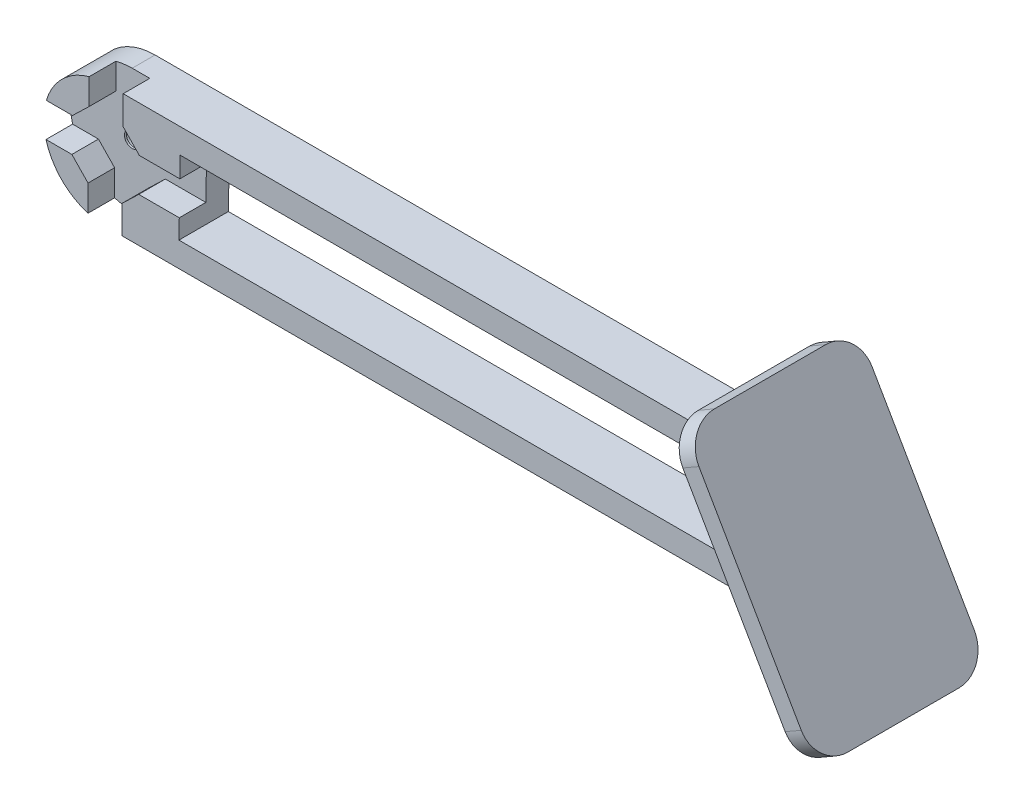
ISO-10303-21;
HEADER;
FILE_DESCRIPTION(('STEP AP214'),'2;1');
FILE_NAME('part.step','',(''),(''),'','','');
FILE_SCHEMA(('AUTOMOTIVE_DESIGN { 1 0 10303 214 1 1 1 1 }'));
ENDSEC;
DATA;
#1=APPLICATION_CONTEXT('core data for automotive mechanical design processes');
#2=APPLICATION_PROTOCOL_DEFINITION('international standard','automotive_design',2000,#1);
#3=PRODUCT_CONTEXT('',#1,'mechanical');
#4=PRODUCT('Part','Part','',(#3));
#5=PRODUCT_RELATED_PRODUCT_CATEGORY('part','',(#4));
#6=PRODUCT_DEFINITION_FORMATION('','',#4);
#7=PRODUCT_DEFINITION_CONTEXT('part definition',#1,'design');
#8=PRODUCT_DEFINITION('design','',#6,#7);
#9=PRODUCT_DEFINITION_SHAPE('','',#8);
#10=(LENGTH_UNIT() NAMED_UNIT(*) SI_UNIT(.MILLI.,.METRE.));
#11=(NAMED_UNIT(*) PLANE_ANGLE_UNIT() SI_UNIT($,.RADIAN.));
#12=(NAMED_UNIT(*) SI_UNIT($,.STERADIAN.) SOLID_ANGLE_UNIT());
#13=UNCERTAINTY_MEASURE_WITH_UNIT(LENGTH_MEASURE(1.E-05),#10,'distance_accuracy_value','');
#14=(GEOMETRIC_REPRESENTATION_CONTEXT(3) GLOBAL_UNCERTAINTY_ASSIGNED_CONTEXT((#13)) GLOBAL_UNIT_ASSIGNED_CONTEXT((#10,
#11,#12)) REPRESENTATION_CONTEXT('',''));
#15=CARTESIAN_POINT('',(0.,0.,0.));
#16=DIRECTION('',(0.,0.,1.));
#17=DIRECTION('',(1.,0.,0.));
#18=AXIS2_PLACEMENT_3D('',#15,#16,#17);
#19=CARTESIAN_POINT('',(0.,10.,8.));
#20=DIRECTION('',(0.,0.,-1.));
#21=DIRECTION('',(-1.,0.,0.));
#22=AXIS2_PLACEMENT_3D('',#19,#20,#21);
#23=PLANE('',#22);
#24=DIRECTION('',(1.,0.,0.));
#25=VECTOR('',#24,1.);
#26=CARTESIAN_POINT('',(11.8571549210606,4.,8.));
#27=LINE('',#26,#25);
#28=CARTESIAN_POINT('',(11.8571549210606,4.,8.));
#29=VERTEX_POINT('',#28);
#30=CARTESIAN_POINT('',(109.607695154587,4.,8.));
#31=VERTEX_POINT('',#30);
#32=EDGE_CURVE('E278',#29,#31,#27,.T.);
#33=ORIENTED_EDGE('',*,*,#32,.F.);
#34=DIRECTION('',(-0.0174947062329612,-0.999846955915665,0.));
#35=VECTOR('',#34,1.);
#36=CARTESIAN_POINT('',(11.8571549210606,4.,8.));
#37=LINE('',#36,#35);
#38=CARTESIAN_POINT('',(11.9123657659527,7.15537708743099,8.));
#39=VERTEX_POINT('',#38);
#40=EDGE_CURVE('E264',#39,#29,#37,.T.);
#41=ORIENTED_EDGE('',*,*,#40,.F.);
#42=DIRECTION('',(1.,0.,0.));
#43=VECTOR('',#42,1.);
#44=CARTESIAN_POINT('',(5.3597141305402,7.15537708743099,8.));
#45=LINE('',#44,#43);
#46=CARTESIAN_POINT('',(5.3597141305402,7.15537708743099,8.));
#47=VERTEX_POINT('',#46);
#48=EDGE_CURVE('E388',#47,#39,#45,.T.);
#49=ORIENTED_EDGE('',*,*,#48,.F.);
#50=DIRECTION('',(0.719369188088886,0.694627937264502,0.));
#51=VECTOR('',#50,1.);
#52=CARTESIAN_POINT('',(2.65537708743099,4.54405025688731,8.));
#53=LINE('',#52,#51);
#54=CARTESIAN_POINT('',(2.65537708743099,4.54405025688731,8.));
#55=VERTEX_POINT('',#54);
#56=EDGE_CURVE('E385',#55,#47,#53,.T.);
#57=ORIENTED_EDGE('',*,*,#56,.F.);
#58=DIRECTION('',(0.,1.,0.));
#59=VECTOR('',#58,1.);
#60=CARTESIAN_POINT('',(2.65537708743099,4.54405025688731,8.));
#61=LINE('',#60,#59);
#62=CARTESIAN_POINT('',(2.65537708743099,0.,8.));
#63=VERTEX_POINT('',#62);
#64=EDGE_CURVE('E383',#63,#55,#61,.T.);
#65=ORIENTED_EDGE('',*,*,#64,.F.);
#66=DIRECTION('',(1.,0.,0.));
#67=VECTOR('',#66,1.);
#68=CARTESIAN_POINT('',(0.,0.,8.));
#69=LINE('',#68,#67);
#70=CARTESIAN_POINT('',(116.535898384862,0.,8.));
#71=VERTEX_POINT('',#70);
#72=EDGE_CURVE('E456',#63,#71,#69,.T.);
#73=ORIENTED_EDGE('',*,*,#72,.T.);
#74=DIRECTION('',(-0.499999999999998,0.86602540378444,0.));
#75=VECTOR('',#74,1.);
#76=CARTESIAN_POINT('',(83.0717967697248,57.9615242270662,8.));
#77=LINE('',#76,#75);
#78=CARTESIAN_POINT('',(104.98889300107,20.,8.));
#79=VERTEX_POINT('',#78);
#80=EDGE_CURVE('E316',#71,#79,#77,.T.);
#81=ORIENTED_EDGE('',*,*,#80,.T.);
#82=DIRECTION('',(-1.,0.,0.));
#83=VECTOR('',#82,1.);
#84=CARTESIAN_POINT('',(0.,20.,8.));
#85=LINE('',#84,#83);
#86=CARTESIAN_POINT('',(2.84462291256901,20.,8.));
#87=VERTEX_POINT('',#86);
#88=EDGE_CURVE('E459',#79,#87,#85,.T.);
#89=ORIENTED_EDGE('',*,*,#88,.T.);
#90=DIRECTION('',(0.,1.,0.));
#91=VECTOR('',#90,1.);
#92=CARTESIAN_POINT('',(2.84462291256901,15.3597141305402,8.));
#93=LINE('',#92,#91);
#94=CARTESIAN_POINT('',(2.84462291256901,15.3597141305402,8.));
#95=VERTEX_POINT('',#94);
#96=EDGE_CURVE('E334',#95,#87,#93,.T.);
#97=ORIENTED_EDGE('',*,*,#96,.F.);
#98=DIRECTION('',(-0.694627937264501,0.719369188088887,0.));
#99=VECTOR('',#98,1.);
#100=CARTESIAN_POINT('',(5.45594974311269,12.655377087431,8.));
#101=LINE('',#100,#99);
#102=CARTESIAN_POINT('',(5.45594974311269,12.655377087431,8.));
#103=VERTEX_POINT('',#102);
#104=EDGE_CURVE('E394',#103,#95,#101,.T.);
#105=ORIENTED_EDGE('',*,*,#104,.F.);
#106=DIRECTION('',(-1.,0.,0.));
#107=VECTOR('',#106,1.);
#108=CARTESIAN_POINT('',(5.45594974311269,12.655377087431,8.));
#109=LINE('',#108,#107);
#110=CARTESIAN_POINT('',(12.0086013785251,12.655377087431,8.));
#111=VERTEX_POINT('',#110);
#112=EDGE_CURVE('E391',#111,#103,#109,.T.);
#113=ORIENTED_EDGE('',*,*,#112,.F.);
#114=CARTESIAN_POINT('',(12.0671235303097,16.,8.));
#115=VERTEX_POINT('',#114);
#116=EDGE_CURVE('E272',#115,#111,#37,.T.);
#117=ORIENTED_EDGE('',*,*,#116,.F.);
#118=DIRECTION('',(-1.,0.,0.));
#119=VECTOR('',#118,1.);
#120=CARTESIAN_POINT('',(12.0671235303097,16.,8.));
#121=LINE('',#120,#119);
#122=CARTESIAN_POINT('',(102.679491924311,16.,8.));
#123=VERTEX_POINT('',#122);
#124=EDGE_CURVE('E265',#123,#115,#121,.T.);
#125=ORIENTED_EDGE('',*,*,#124,.F.);
#126=DIRECTION('',(-0.5,0.866025403784439,0.));
#127=VECTOR('',#126,1.);
#128=CARTESIAN_POINT('',(109.607695154587,4.,8.));
#129=LINE('',#128,#127);
#130=EDGE_CURVE('E280',#31,#123,#129,.T.);
#131=ORIENTED_EDGE('',*,*,#130,.F.);
#132=EDGE_LOOP('',(#33,#41,#49,#57,#65,#73,#81,#89,#97,#105,#113,#117,#125,#131));
#133=FACE_BOUND('',#132,.T.);
#134=ADVANCED_FACE('F35',(#133),#23,.F.);
#135=CARTESIAN_POINT('',(0.,10.,8.));
#136=DIRECTION('',(0.,0.,1.));
#137=DIRECTION('',(-1.,0.,0.));
#138=AXIS2_PLACEMENT_3D('',#135,#136,#137);
#139=CIRCLE('',#138,10.);
#140=CARTESIAN_POINT('',(-9.64100474657837,7.34462291256902,8.));
#141=VERTEX_POINT('',#140);
#142=CARTESIAN_POINT('',(-2.84462291256901,0.413127700585169,8.));
#143=VERTEX_POINT('',#142);
#144=EDGE_CURVE('E451',#141,#143,#139,.T.);
#145=ORIENTED_EDGE('',*,*,#144,.T.);
#146=DIRECTION('',(0.,-1.,0.));
#147=VECTOR('',#146,1.);
#148=CARTESIAN_POINT('',(-2.84462291256901,-1.91236576595265,8.));
#149=LINE('',#148,#147);
#150=CARTESIAN_POINT('',(-2.84462291256901,4.6402858694598,8.));
#151=VERTEX_POINT('',#150);
#152=EDGE_CURVE('E381',#151,#143,#149,.T.);
#153=ORIENTED_EDGE('',*,*,#152,.F.);
#154=DIRECTION('',(0.694627937264501,-0.719369188088887,0.));
#155=VECTOR('',#154,1.);
#156=CARTESIAN_POINT('',(-5.45594974311269,7.34462291256902,8.));
#157=LINE('',#156,#155);
#158=CARTESIAN_POINT('',(-5.45594974311269,7.34462291256902,8.));
#159=VERTEX_POINT('',#158);
#160=EDGE_CURVE('E378',#159,#151,#157,.T.);
#161=ORIENTED_EDGE('',*,*,#160,.F.);
#162=DIRECTION('',(1.,0.,0.));
#163=VECTOR('',#162,1.);
#164=CARTESIAN_POINT('',(-5.45594974311269,7.34462291256902,8.));
#165=LINE('',#164,#163);
#166=EDGE_CURVE('E376',#141,#159,#165,.T.);
#167=ORIENTED_EDGE('',*,*,#166,.F.);
#168=EDGE_LOOP('',(#145,#153,#161,#167));
#169=FACE_BOUND('',#168,.T.);
#170=ADVANCED_FACE('F545',(#169),#23,.F.);
#171=CARTESIAN_POINT('',(0.,10.,8.));
#172=DIRECTION('',(0.,0.,-1.));
#173=DIRECTION('',(-1.,0.,0.));
#174=AXIS2_PLACEMENT_3D('',#171,#172,#173);
#175=CYLINDRICAL_SURFACE('',#174,10.);
#176=CARTESIAN_POINT('',(-2.65537708743099,19.6410047465784,8.));
#177=VERTEX_POINT('',#176);
#178=CARTESIAN_POINT('',(-9.58687229941484,12.844622912569,8.));
#179=VERTEX_POINT('',#178);
#180=EDGE_CURVE('E454',#177,#179,#139,.T.);
#181=ORIENTED_EDGE('',*,*,#180,.F.);
#182=DIRECTION('',(0.,0.,-1.));
#183=VECTOR('',#182,1.);
#184=CARTESIAN_POINT('',(-2.65537708743099,19.6410047465784,8.));
#185=LINE('',#184,#183);
#186=CARTESIAN_POINT('',(-2.65537708743099,19.6410047465784,3.7));
#187=VERTEX_POINT('',#186);
#188=EDGE_CURVE('E447',#177,#187,#185,.T.);
#189=ORIENTED_EDGE('',*,*,#188,.T.);
#190=CARTESIAN_POINT('',(0.,10.,3.7));
#191=DIRECTION('',(0.,0.,-1.));
#192=DIRECTION('',(-1.,0.,0.));
#193=AXIS2_PLACEMENT_3D('',#190,#191,#192);
#194=CIRCLE('',#193,10.);
#195=CARTESIAN_POINT('',(0.,20.,3.7));
#196=VERTEX_POINT('',#195);
#197=EDGE_CURVE('E424',#187,#196,#194,.T.);
#198=ORIENTED_EDGE('',*,*,#197,.T.);
#199=DIRECTION('',(0.,0.,-1.));
#200=VECTOR('',#199,1.);
#201=CARTESIAN_POINT('',(0.,20.,8.));
#202=LINE('',#201,#200);
#203=CARTESIAN_POINT('',(0.,20.,0.));
#204=VERTEX_POINT('',#203);
#205=EDGE_CURVE('E461',#196,#204,#202,.T.);
#206=ORIENTED_EDGE('',*,*,#205,.T.);
#207=CARTESIAN_POINT('',(0.,10.,0.));
#208=DIRECTION('',(0.,0.,1.));
#209=DIRECTION('',(-1.,0.,0.));
#210=AXIS2_PLACEMENT_3D('',#207,#208,#209);
#211=CIRCLE('',#210,10.);
#212=CARTESIAN_POINT('',(0.,0.,0.));
#213=VERTEX_POINT('',#212);
#214=EDGE_CURVE('E450',#204,#213,#211,.T.);
#215=ORIENTED_EDGE('',*,*,#214,.T.);
#216=DIRECTION('',(0.,0.,-1.));
#217=VECTOR('',#216,1.);
#218=CARTESIAN_POINT('',(0.,0.,8.));
#219=LINE('',#218,#217);
#220=CARTESIAN_POINT('',(0.,0.,3.7));
#221=VERTEX_POINT('',#220);
#222=EDGE_CURVE('E470',#221,#213,#219,.T.);
#223=ORIENTED_EDGE('',*,*,#222,.F.);
#224=CARTESIAN_POINT('',(-2.84462291256901,0.413127700585169,3.7));
#225=VERTEX_POINT('',#224);
#226=EDGE_CURVE('E429',#221,#225,#194,.T.);
#227=ORIENTED_EDGE('',*,*,#226,.T.);
#228=DIRECTION('',(0.,0.,-1.));
#229=VECTOR('',#228,1.);
#230=CARTESIAN_POINT('',(-2.84462291256901,0.413127700585171,8.));
#231=LINE('',#230,#229);
#232=EDGE_CURVE('E438',#225,#143,#231,.F.);
#233=ORIENTED_EDGE('',*,*,#232,.T.);
#234=ORIENTED_EDGE('',*,*,#144,.F.);
#235=DIRECTION('',(0.,0.,-1.));
#236=VECTOR('',#235,1.);
#237=CARTESIAN_POINT('',(-9.64100474657837,7.34462291256902,8.));
#238=LINE('',#237,#236);
#239=CARTESIAN_POINT('',(-9.64100474657837,7.34462291256902,3.7));
#240=VERTEX_POINT('',#239);
#241=EDGE_CURVE('E435',#141,#240,#238,.T.);
#242=ORIENTED_EDGE('',*,*,#241,.T.);
#243=CARTESIAN_POINT('',(-9.58687229941484,12.844622912569,3.7));
#244=VERTEX_POINT('',#243);
#245=EDGE_CURVE('E428',#240,#244,#194,.T.);
#246=ORIENTED_EDGE('',*,*,#245,.T.);
#247=DIRECTION('',(0.,0.,-1.));
#248=VECTOR('',#247,1.);
#249=CARTESIAN_POINT('',(-9.58687229941484,12.844622912569,8.));
#250=LINE('',#249,#248);
#251=EDGE_CURVE('E432',#244,#179,#250,.F.);
#252=ORIENTED_EDGE('',*,*,#251,.T.);
#253=EDGE_LOOP('',(#181,#189,#198,#206,#215,#223,#227,#233,#234,#242,#246,#252));
#254=FACE_BOUND('',#253,.T.);
#255=ADVANCED_FACE('F552',(#254),#175,.T.);
#256=CARTESIAN_POINT('',(0.,0.,8.));
#257=DIRECTION('',(0.,1.,0.));
#258=DIRECTION('',(0.,0.,1.));
#259=AXIS2_PLACEMENT_3D('',#256,#257,#258);
#260=PLANE('',#259);
#261=DIRECTION('',(1.,0.,0.));
#262=VECTOR('',#261,1.);
#263=CARTESIAN_POINT('',(0.,0.,0.));
#264=LINE('',#263,#262);
#265=CARTESIAN_POINT('',(116.535898384862,0.,0.));
#266=VERTEX_POINT('',#265);
#267=EDGE_CURVE('E464',#213,#266,#264,.T.);
#268=ORIENTED_EDGE('',*,*,#267,.T.);
#269=DIRECTION('',(0.,0.,1.));
#270=VECTOR('',#269,1.);
#271=CARTESIAN_POINT('',(116.535898384862,0.,8.));
#272=LINE('',#271,#270);
#273=EDGE_CURVE('E314',#266,#71,#272,.T.);
#274=ORIENTED_EDGE('',*,*,#273,.T.);
#275=ORIENTED_EDGE('',*,*,#72,.F.);
#276=DIRECTION('',(0.,0.,-1.));
#277=VECTOR('',#276,1.);
#278=CARTESIAN_POINT('',(2.65537708743099,0.,8.));
#279=LINE('',#278,#277);
#280=CARTESIAN_POINT('',(2.65537708743099,0.,3.7));
#281=VERTEX_POINT('',#280);
#282=EDGE_CURVE('E441',#63,#281,#279,.T.);
#283=ORIENTED_EDGE('',*,*,#282,.T.);
#284=DIRECTION('',(-1.,0.,0.));
#285=VECTOR('',#284,1.);
#286=CARTESIAN_POINT('',(0.,0.,3.7));
#287=LINE('',#286,#285);
#288=EDGE_CURVE('E427',#281,#221,#287,.T.);
#289=ORIENTED_EDGE('',*,*,#288,.T.);
#290=ORIENTED_EDGE('',*,*,#222,.T.);
#291=EDGE_LOOP('',(#268,#274,#275,#283,#289,#290));
#292=FACE_BOUND('',#291,.T.);
#293=ADVANCED_FACE('F564',(#292),#260,.F.);
#294=CARTESIAN_POINT('',(0.,20.,8.));
#295=DIRECTION('',(0.,-1.,0.));
#296=DIRECTION('',(0.,0.,-1.));
#297=AXIS2_PLACEMENT_3D('',#294,#295,#296);
#298=PLANE('',#297);
#299=ORIENTED_EDGE('',*,*,#88,.F.);
#300=DIRECTION('',(0.,0.,-1.));
#301=VECTOR('',#300,1.);
#302=CARTESIAN_POINT('',(104.98889300107,20.,8.));
#303=LINE('',#302,#301);
#304=CARTESIAN_POINT('',(104.98889300107,20.,0.));
#305=VERTEX_POINT('',#304);
#306=EDGE_CURVE('E301',#79,#305,#303,.T.);
#307=ORIENTED_EDGE('',*,*,#306,.T.);
#308=DIRECTION('',(-1.,0.,0.));
#309=VECTOR('',#308,1.);
#310=CARTESIAN_POINT('',(0.,20.,0.));
#311=LINE('',#310,#309);
#312=EDGE_CURVE('E455',#305,#204,#311,.T.);
#313=ORIENTED_EDGE('',*,*,#312,.T.);
#314=ORIENTED_EDGE('',*,*,#205,.F.);
#315=DIRECTION('',(1.,0.,0.));
#316=VECTOR('',#315,1.);
#317=CARTESIAN_POINT('',(0.,20.,3.7));
#318=LINE('',#317,#316);
#319=CARTESIAN_POINT('',(2.84462291256901,20.,3.7));
#320=VERTEX_POINT('',#319);
#321=EDGE_CURVE('E401',#196,#320,#318,.T.);
#322=ORIENTED_EDGE('',*,*,#321,.T.);
#323=DIRECTION('',(0.,0.,1.));
#324=VECTOR('',#323,1.);
#325=CARTESIAN_POINT('',(2.84462291256901,20.,8.));
#326=LINE('',#325,#324);
#327=EDGE_CURVE('E444',#320,#87,#326,.T.);
#328=ORIENTED_EDGE('',*,*,#327,.T.);
#329=EDGE_LOOP('',(#299,#307,#313,#314,#322,#328));
#330=FACE_BOUND('',#329,.T.);
#331=ADVANCED_FACE('F557',(#330),#298,.F.);
#332=DIRECTION('',(-0.719369188088887,-0.694627937264501,0.));
#333=VECTOR('',#332,1.);
#334=CARTESIAN_POINT('',(-2.65537708743099,15.4559497431127,8.));
#335=LINE('',#334,#333);
#336=CARTESIAN_POINT('',(-2.65537708743099,15.4559497431127,8.));
#337=VERTEX_POINT('',#336);
#338=CARTESIAN_POINT('',(-5.3597141305402,12.844622912569,8.));
#339=VERTEX_POINT('',#338);
#340=EDGE_CURVE('E371',#337,#339,#335,.T.);
#341=ORIENTED_EDGE('',*,*,#340,.F.);
#342=DIRECTION('',(0.,-1.,0.));
#343=VECTOR('',#342,1.);
#344=CARTESIAN_POINT('',(-2.65537708743099,15.4559497431127,8.));
#345=LINE('',#344,#343);
#346=EDGE_CURVE('E328',#177,#337,#345,.T.);
#347=ORIENTED_EDGE('',*,*,#346,.F.);
#348=ORIENTED_EDGE('',*,*,#180,.T.);
#349=DIRECTION('',(-1.,0.,0.));
#350=VECTOR('',#349,1.);
#351=CARTESIAN_POINT('',(-5.3597141305402,12.844622912569,8.));
#352=LINE('',#351,#350);
#353=EDGE_CURVE('E374',#339,#179,#352,.T.);
#354=ORIENTED_EDGE('',*,*,#353,.F.);
#355=EDGE_LOOP('',(#341,#347,#348,#354));
#356=FACE_BOUND('',#355,.T.);
#357=ADVANCED_FACE('F548',(#356),#23,.F.);
#358=CARTESIAN_POINT('',(0.,10.,0.));
#359=DIRECTION('',(0.,0.,-1.));
#360=DIRECTION('',(-1.,0.,0.));
#361=AXIS2_PLACEMENT_3D('',#358,#359,#360);
#362=PLANE('',#361);
#363=DIRECTION('',(-0.0174947062329612,-0.999846955915665,0.));
#364=VECTOR('',#363,1.);
#365=CARTESIAN_POINT('',(11.8571549210606,4.,0.));
#366=LINE('',#365,#364);
#367=CARTESIAN_POINT('',(12.0671235303097,16.,0.));
#368=VERTEX_POINT('',#367);
#369=CARTESIAN_POINT('',(11.8571549210606,4.,0.));
#370=VERTEX_POINT('',#369);
#371=EDGE_CURVE('E261',#368,#370,#366,.T.);
#372=ORIENTED_EDGE('',*,*,#371,.T.);
#373=DIRECTION('',(1.,0.,0.));
#374=VECTOR('',#373,1.);
#375=CARTESIAN_POINT('',(11.8571549210606,4.,0.));
#376=LINE('',#375,#374);
#377=CARTESIAN_POINT('',(109.607695154587,4.,0.));
#378=VERTEX_POINT('',#377);
#379=EDGE_CURVE('E245',#370,#378,#376,.T.);
#380=ORIENTED_EDGE('',*,*,#379,.T.);
#381=DIRECTION('',(-0.5,0.866025403784439,0.));
#382=VECTOR('',#381,1.);
#383=CARTESIAN_POINT('',(109.607695154587,4.,0.));
#384=LINE('',#383,#382);
#385=CARTESIAN_POINT('',(102.679491924311,16.,0.));
#386=VERTEX_POINT('',#385);
#387=EDGE_CURVE('E274',#378,#386,#384,.T.);
#388=ORIENTED_EDGE('',*,*,#387,.T.);
#389=DIRECTION('',(-1.,0.,0.));
#390=VECTOR('',#389,1.);
#391=CARTESIAN_POINT('',(12.0671235303097,16.,0.));
#392=LINE('',#391,#390);
#393=EDGE_CURVE('E270',#386,#368,#392,.T.);
#394=ORIENTED_EDGE('',*,*,#393,.T.);
#395=EDGE_LOOP('',(#372,#380,#388,#394));
#396=FACE_BOUND('',#395,.T.);
#397=DIRECTION('',(-0.499999999999998,0.86602540378444,0.));
#398=VECTOR('',#397,1.);
#399=CARTESIAN_POINT('',(83.0717967697248,57.9615242270662,0.));
#400=LINE('',#399,#398);
#401=EDGE_CURVE('E472',#266,#305,#400,.T.);
#402=ORIENTED_EDGE('',*,*,#401,.F.);
#403=ORIENTED_EDGE('',*,*,#267,.F.);
#404=ORIENTED_EDGE('',*,*,#214,.F.);
#405=ORIENTED_EDGE('',*,*,#312,.F.);
#406=EDGE_LOOP('',(#402,#403,#404,#405));
#407=FACE_BOUND('',#406,.T.);
#408=CARTESIAN_POINT('',(0.,10.,0.));
#409=DIRECTION('',(0.,0.,-1.));
#410=DIRECTION('',(-1.,0.,0.));
#411=AXIS2_PLACEMENT_3D('',#408,#409,#410);
#412=CIRCLE('',#411,2.5);
#413=CARTESIAN_POINT('',(-2.5,10.,0.));
#414=VERTEX_POINT('',#413);
#415=EDGE_CURVE('E322',#414,#414,#412,.T.);
#416=ORIENTED_EDGE('',*,*,#415,.F.);
#417=EDGE_LOOP('',(#416));
#418=FACE_BOUND('',#417,.T.);
#419=ADVANCED_FACE('F268',(#396,#407,#418),#362,.T.);
#420=CARTESIAN_POINT('',(-2.65537708743099,15.4559497431127,3.7));
#421=DIRECTION('',(-1.,0.,0.));
#422=DIRECTION('',(0.,0.,1.));
#423=AXIS2_PLACEMENT_3D('',#420,#421,#422);
#424=PLANE('',#423);
#425=ORIENTED_EDGE('',*,*,#346,.T.);
#426=DIRECTION('',(0.,0.,1.));
#427=VECTOR('',#426,1.);
#428=CARTESIAN_POINT('',(-2.65537708743099,15.4559497431127,3.7));
#429=LINE('',#428,#427);
#430=CARTESIAN_POINT('',(-2.65537708743099,15.4559497431127,3.7));
#431=VERTEX_POINT('',#430);
#432=EDGE_CURVE('E368',#431,#337,#429,.T.);
#433=ORIENTED_EDGE('',*,*,#432,.F.);
#434=DIRECTION('',(0.,-1.,0.));
#435=VECTOR('',#434,1.);
#436=CARTESIAN_POINT('',(-2.65537708743099,15.4559497431127,3.7));
#437=LINE('',#436,#435);
#438=EDGE_CURVE('E331',#187,#431,#437,.T.);
#439=ORIENTED_EDGE('',*,*,#438,.F.);
#440=ORIENTED_EDGE('',*,*,#188,.F.);
#441=EDGE_LOOP('',(#425,#433,#439,#440));
#442=FACE_BOUND('',#441,.T.);
#443=ADVANCED_FACE('F563',(#442),#424,.F.);
#444=CARTESIAN_POINT('',(2.84462291256901,15.3597141305402,3.7));
#445=DIRECTION('',(1.,0.,0.));
#446=DIRECTION('',(0.,0.,-1.));
#447=AXIS2_PLACEMENT_3D('',#444,#445,#446);
#448=PLANE('',#447);
#449=DIRECTION('',(0.,1.,0.));
#450=VECTOR('',#449,1.);
#451=CARTESIAN_POINT('',(2.84462291256901,15.3597141305402,3.7));
#452=LINE('',#451,#450);
#453=CARTESIAN_POINT('',(2.84462291256901,15.3597141305402,3.7));
#454=VERTEX_POINT('',#453);
#455=EDGE_CURVE('E365',#454,#320,#452,.T.);
#456=ORIENTED_EDGE('',*,*,#455,.F.);
#457=DIRECTION('',(0.,0.,1.));
#458=VECTOR('',#457,1.);
#459=CARTESIAN_POINT('',(2.84462291256901,15.3597141305402,3.7));
#460=LINE('',#459,#458);
#461=EDGE_CURVE('E399',#454,#95,#460,.T.);
#462=ORIENTED_EDGE('',*,*,#461,.T.);
#463=ORIENTED_EDGE('',*,*,#96,.T.);
#464=ORIENTED_EDGE('',*,*,#327,.F.);
#465=EDGE_LOOP('',(#456,#462,#463,#464));
#466=FACE_BOUND('',#465,.T.);
#467=ADVANCED_FACE('F627',(#466),#448,.F.);
#468=CARTESIAN_POINT('',(2.65537708743099,4.54405025688731,3.7));
#469=DIRECTION('',(1.,0.,0.));
#470=DIRECTION('',(0.,0.,-1.));
#471=AXIS2_PLACEMENT_3D('',#468,#469,#470);
#472=PLANE('',#471);
#473=ORIENTED_EDGE('',*,*,#64,.T.);
#474=DIRECTION('',(0.,0.,1.));
#475=VECTOR('',#474,1.);
#476=CARTESIAN_POINT('',(2.65537708743099,4.54405025688731,3.7));
#477=LINE('',#476,#475);
#478=CARTESIAN_POINT('',(2.65537708743099,4.54405025688731,3.7));
#479=VERTEX_POINT('',#478);
#480=EDGE_CURVE('E411',#479,#55,#477,.T.);
#481=ORIENTED_EDGE('',*,*,#480,.F.);
#482=DIRECTION('',(0.,1.,0.));
#483=VECTOR('',#482,1.);
#484=CARTESIAN_POINT('',(2.65537708743099,4.54405025688731,3.7));
#485=LINE('',#484,#483);
#486=EDGE_CURVE('E348',#281,#479,#485,.T.);
#487=ORIENTED_EDGE('',*,*,#486,.F.);
#488=ORIENTED_EDGE('',*,*,#282,.F.);
#489=EDGE_LOOP('',(#473,#481,#487,#488));
#490=FACE_BOUND('',#489,.T.);
#491=ADVANCED_FACE('F603',(#490),#472,.F.);
#492=CARTESIAN_POINT('',(-2.84462291256901,-1.91236576595265,3.7));
#493=DIRECTION('',(-1.,0.,0.));
#494=DIRECTION('',(0.,0.,1.));
#495=AXIS2_PLACEMENT_3D('',#492,#493,#494);
#496=PLANE('',#495);
#497=DIRECTION('',(0.,-1.,0.));
#498=VECTOR('',#497,1.);
#499=CARTESIAN_POINT('',(-2.84462291256901,-1.91236576595265,3.7));
#500=LINE('',#499,#498);
#501=CARTESIAN_POINT('',(-2.84462291256901,4.6402858694598,3.7));
#502=VERTEX_POINT('',#501);
#503=EDGE_CURVE('E345',#502,#225,#500,.T.);
#504=ORIENTED_EDGE('',*,*,#503,.F.);
#505=DIRECTION('',(0.,0.,1.));
#506=VECTOR('',#505,1.);
#507=CARTESIAN_POINT('',(-2.84462291256901,4.6402858694598,3.7));
#508=LINE('',#507,#506);
#509=EDGE_CURVE('E414',#502,#151,#508,.T.);
#510=ORIENTED_EDGE('',*,*,#509,.T.);
#511=ORIENTED_EDGE('',*,*,#152,.T.);
#512=ORIENTED_EDGE('',*,*,#232,.F.);
#513=EDGE_LOOP('',(#504,#510,#511,#512));
#514=FACE_BOUND('',#513,.T.);
#515=ADVANCED_FACE('F619',(#514),#496,.F.);
#516=CARTESIAN_POINT('',(-5.45594974311269,7.34462291256902,3.7));
#517=DIRECTION('',(0.,-1.,0.));
#518=DIRECTION('',(0.,0.,-1.));
#519=AXIS2_PLACEMENT_3D('',#516,#517,#518);
#520=PLANE('',#519);
#521=ORIENTED_EDGE('',*,*,#166,.T.);
#522=DIRECTION('',(0.,0.,1.));
#523=VECTOR('',#522,1.);
#524=CARTESIAN_POINT('',(-5.45594974311269,7.34462291256902,3.7));
#525=LINE('',#524,#523);
#526=CARTESIAN_POINT('',(-5.45594974311269,7.34462291256902,3.7));
#527=VERTEX_POINT('',#526);
#528=EDGE_CURVE('E416',#527,#159,#525,.T.);
#529=ORIENTED_EDGE('',*,*,#528,.F.);
#530=DIRECTION('',(1.,0.,0.));
#531=VECTOR('',#530,1.);
#532=CARTESIAN_POINT('',(-5.45594974311269,7.34462291256902,3.7));
#533=LINE('',#532,#531);
#534=EDGE_CURVE('E340',#240,#527,#533,.T.);
#535=ORIENTED_EDGE('',*,*,#534,.F.);
#536=ORIENTED_EDGE('',*,*,#241,.F.);
#537=EDGE_LOOP('',(#521,#529,#535,#536));
#538=FACE_BOUND('',#537,.T.);
#539=ADVANCED_FACE('F615',(#538),#520,.F.);
#540=CARTESIAN_POINT('',(-5.3597141305402,12.844622912569,3.7));
#541=DIRECTION('',(0.,1.,0.));
#542=DIRECTION('',(0.,0.,1.));
#543=AXIS2_PLACEMENT_3D('',#540,#541,#542);
#544=PLANE('',#543);
#545=DIRECTION('',(-1.,0.,0.));
#546=VECTOR('',#545,1.);
#547=CARTESIAN_POINT('',(-5.3597141305402,12.844622912569,3.7));
#548=LINE('',#547,#546);
#549=CARTESIAN_POINT('',(-5.3597141305402,12.844622912569,3.7));
#550=VERTEX_POINT('',#549);
#551=EDGE_CURVE('E337',#550,#244,#548,.T.);
#552=ORIENTED_EDGE('',*,*,#551,.F.);
#553=DIRECTION('',(0.,0.,1.));
#554=VECTOR('',#553,1.);
#555=CARTESIAN_POINT('',(-5.3597141305402,12.844622912569,3.7));
#556=LINE('',#555,#554);
#557=EDGE_CURVE('E419',#550,#339,#556,.T.);
#558=ORIENTED_EDGE('',*,*,#557,.T.);
#559=ORIENTED_EDGE('',*,*,#353,.T.);
#560=ORIENTED_EDGE('',*,*,#251,.F.);
#561=EDGE_LOOP('',(#552,#558,#559,#560));
#562=FACE_BOUND('',#561,.T.);
#563=ADVANCED_FACE('F583',(#562),#544,.F.);
#564=CARTESIAN_POINT('',(5.45594974311269,12.655377087431,3.7));
#565=DIRECTION('',(0.719369188088887,0.694627937264501,0.));
#566=DIRECTION('',(-0.694627937264501,0.719369188088887,0.));
#567=AXIS2_PLACEMENT_3D('',#564,#565,#566);
#568=PLANE('',#567);
#569=ORIENTED_EDGE('',*,*,#104,.T.);
#570=ORIENTED_EDGE('',*,*,#461,.F.);
#571=DIRECTION('',(-0.694627937264501,0.719369188088887,0.));
#572=VECTOR('',#571,1.);
#573=CARTESIAN_POINT('',(5.45594974311269,12.655377087431,3.7));
#574=LINE('',#573,#572);
#575=CARTESIAN_POINT('',(5.45594974311269,12.655377087431,3.7));
#576=VERTEX_POINT('',#575);
#577=EDGE_CURVE('E362',#576,#454,#574,.T.);
#578=ORIENTED_EDGE('',*,*,#577,.F.);
#579=DIRECTION('',(0.,0.,1.));
#580=VECTOR('',#579,1.);
#581=CARTESIAN_POINT('',(5.45594974311269,12.655377087431,3.7));
#582=LINE('',#581,#580);
#583=EDGE_CURVE('E402',#576,#103,#582,.T.);
#584=ORIENTED_EDGE('',*,*,#583,.T.);
#585=EDGE_LOOP('',(#569,#570,#578,#584));
#586=FACE_BOUND('',#585,.T.);
#587=ADVANCED_FACE('F636',(#586),#568,.F.);
#588=CARTESIAN_POINT('',(5.45594974311269,12.655377087431,3.7));
#589=DIRECTION('',(0.,1.,0.));
#590=DIRECTION('',(0.,0.,1.));
#591=AXIS2_PLACEMENT_3D('',#588,#589,#590);
#592=PLANE('',#591);
#593=ORIENTED_EDGE('',*,*,#112,.T.);
#594=ORIENTED_EDGE('',*,*,#583,.F.);
#595=DIRECTION('',(-1.,0.,0.));
#596=VECTOR('',#595,1.);
#597=CARTESIAN_POINT('',(5.45594974311269,12.655377087431,3.7));
#598=LINE('',#597,#596);
#599=CARTESIAN_POINT('',(12.0086013785251,12.655377087431,3.7));
#600=VERTEX_POINT('',#599);
#601=EDGE_CURVE('E359',#600,#576,#598,.T.);
#602=ORIENTED_EDGE('',*,*,#601,.F.);
#603=DIRECTION('',(0.,0.,1.));
#604=VECTOR('',#603,1.);
#605=CARTESIAN_POINT('',(12.0086013785251,12.655377087431,3.7));
#606=LINE('',#605,#604);
#607=EDGE_CURVE('E404',#600,#111,#606,.T.);
#608=ORIENTED_EDGE('',*,*,#607,.T.);
#609=EDGE_LOOP('',(#593,#594,#602,#608));
#610=FACE_BOUND('',#609,.T.);
#611=ADVANCED_FACE('F672',(#610),#592,.F.);
#612=CARTESIAN_POINT('',(5.3597141305402,7.15537708743099,3.7));
#613=DIRECTION('',(0.,-1.,0.));
#614=DIRECTION('',(1.,0.,0.));
#615=AXIS2_PLACEMENT_3D('',#612,#613,#614);
#616=PLANE('',#615);
#617=ORIENTED_EDGE('',*,*,#48,.T.);
#618=DIRECTION('',(0.,0.,1.));
#619=VECTOR('',#618,1.);
#620=CARTESIAN_POINT('',(11.9123657659527,7.15537708743099,3.7));
#621=LINE('',#620,#619);
#622=CARTESIAN_POINT('',(11.9123657659527,7.15537708743099,3.7));
#623=VERTEX_POINT('',#622);
#624=EDGE_CURVE('E407',#623,#39,#621,.T.);
#625=ORIENTED_EDGE('',*,*,#624,.F.);
#626=DIRECTION('',(1.,0.,0.));
#627=VECTOR('',#626,1.);
#628=CARTESIAN_POINT('',(5.3597141305402,7.15537708743099,3.7));
#629=LINE('',#628,#627);
#630=CARTESIAN_POINT('',(5.3597141305402,7.15537708743099,3.7));
#631=VERTEX_POINT('',#630);
#632=EDGE_CURVE('E353',#631,#623,#629,.T.);
#633=ORIENTED_EDGE('',*,*,#632,.F.);
#634=DIRECTION('',(0.,0.,1.));
#635=VECTOR('',#634,1.);
#636=CARTESIAN_POINT('',(5.3597141305402,7.15537708743099,3.7));
#637=LINE('',#636,#635);
#638=EDGE_CURVE('E409',#631,#47,#637,.T.);
#639=ORIENTED_EDGE('',*,*,#638,.T.);
#640=EDGE_LOOP('',(#617,#625,#633,#639));
#641=FACE_BOUND('',#640,.T.);
#642=ADVANCED_FACE('F676',(#641),#616,.F.);
#643=CARTESIAN_POINT('',(2.65537708743099,4.54405025688731,3.7));
#644=DIRECTION('',(0.694627937264502,-0.719369188088886,0.));
#645=DIRECTION('',(0.719369188088886,0.694627937264502,0.));
#646=AXIS2_PLACEMENT_3D('',#643,#644,#645);
#647=PLANE('',#646);
#648=ORIENTED_EDGE('',*,*,#56,.T.);
#649=ORIENTED_EDGE('',*,*,#638,.F.);
#650=DIRECTION('',(0.719369188088886,0.694627937264502,0.));
#651=VECTOR('',#650,1.);
#652=CARTESIAN_POINT('',(2.65537708743099,4.54405025688731,3.7));
#653=LINE('',#652,#651);
#654=EDGE_CURVE('E350',#479,#631,#653,.T.);
#655=ORIENTED_EDGE('',*,*,#654,.F.);
#656=ORIENTED_EDGE('',*,*,#480,.T.);
#657=EDGE_LOOP('',(#648,#649,#655,#656));
#658=FACE_BOUND('',#657,.T.);
#659=ADVANCED_FACE('F632',(#658),#647,.F.);
#660=CARTESIAN_POINT('',(-5.45594974311269,7.34462291256902,3.7));
#661=DIRECTION('',(-0.719369188088887,-0.694627937264501,0.));
#662=DIRECTION('',(0.694627937264501,-0.719369188088887,0.));
#663=AXIS2_PLACEMENT_3D('',#660,#661,#662);
#664=PLANE('',#663);
#665=ORIENTED_EDGE('',*,*,#160,.T.);
#666=ORIENTED_EDGE('',*,*,#509,.F.);
#667=DIRECTION('',(0.694627937264501,-0.719369188088887,0.));
#668=VECTOR('',#667,1.);
#669=CARTESIAN_POINT('',(-5.45594974311269,7.34462291256902,3.7));
#670=LINE('',#669,#668);
#671=EDGE_CURVE('E342',#527,#502,#670,.T.);
#672=ORIENTED_EDGE('',*,*,#671,.F.);
#673=ORIENTED_EDGE('',*,*,#528,.T.);
#674=EDGE_LOOP('',(#665,#666,#672,#673));
#675=FACE_BOUND('',#674,.T.);
#676=ADVANCED_FACE('F618',(#675),#664,.F.);
#677=CARTESIAN_POINT('',(-2.65537708743099,15.4559497431127,3.7));
#678=DIRECTION('',(-0.694627937264501,0.719369188088887,0.));
#679=DIRECTION('',(-0.719369188088887,-0.694627937264501,0.));
#680=AXIS2_PLACEMENT_3D('',#677,#678,#679);
#681=PLANE('',#680);
#682=ORIENTED_EDGE('',*,*,#340,.T.);
#683=ORIENTED_EDGE('',*,*,#557,.F.);
#684=DIRECTION('',(-0.719369188088887,-0.694627937264501,0.));
#685=VECTOR('',#684,1.);
#686=CARTESIAN_POINT('',(-2.65537708743099,15.4559497431127,3.7));
#687=LINE('',#686,#685);
#688=EDGE_CURVE('E333',#431,#550,#687,.T.);
#689=ORIENTED_EDGE('',*,*,#688,.F.);
#690=ORIENTED_EDGE('',*,*,#432,.T.);
#691=EDGE_LOOP('',(#682,#683,#689,#690));
#692=FACE_BOUND('',#691,.T.);
#693=ADVANCED_FACE('F573',(#692),#681,.F.);
#694=CARTESIAN_POINT('',(0.,10.,3.7));
#695=DIRECTION('',(0.,0.,1.));
#696=DIRECTION('',(1.,0.,0.));
#697=AXIS2_PLACEMENT_3D('',#694,#695,#696);
#698=PLANE('',#697);
#699=CARTESIAN_POINT('',(0.,10.,3.7));
#700=DIRECTION('',(0.,0.,1.));
#701=DIRECTION('',(1.,0.,0.));
#702=AXIS2_PLACEMENT_3D('',#699,#700,#701);
#703=CIRCLE('',#702,1.25);
#704=CARTESIAN_POINT('',(1.25,10.,3.7));
#705=VERTEX_POINT('',#704);
#706=EDGE_CURVE('E318',#705,#705,#703,.F.);
#707=ORIENTED_EDGE('',*,*,#706,.T.);
#708=EDGE_LOOP('',(#707));
#709=FACE_BOUND('',#708,.T.);
#710=ORIENTED_EDGE('',*,*,#534,.T.);
#711=ORIENTED_EDGE('',*,*,#671,.T.);
#712=ORIENTED_EDGE('',*,*,#503,.T.);
#713=ORIENTED_EDGE('',*,*,#226,.F.);
#714=ORIENTED_EDGE('',*,*,#288,.F.);
#715=ORIENTED_EDGE('',*,*,#486,.T.);
#716=ORIENTED_EDGE('',*,*,#654,.T.);
#717=ORIENTED_EDGE('',*,*,#632,.T.);
#718=DIRECTION('',(0.0174947062329611,0.999846955915665,0.));
#719=VECTOR('',#718,1.);
#720=CARTESIAN_POINT('',(12.0086013785251,12.655377087431,3.7));
#721=LINE('',#720,#719);
#722=EDGE_CURVE('E356',#623,#600,#721,.T.);
#723=ORIENTED_EDGE('',*,*,#722,.T.);
#724=ORIENTED_EDGE('',*,*,#601,.T.);
#725=ORIENTED_EDGE('',*,*,#577,.T.);
#726=ORIENTED_EDGE('',*,*,#455,.T.);
#727=ORIENTED_EDGE('',*,*,#321,.F.);
#728=ORIENTED_EDGE('',*,*,#197,.F.);
#729=ORIENTED_EDGE('',*,*,#438,.T.);
#730=ORIENTED_EDGE('',*,*,#688,.T.);
#731=ORIENTED_EDGE('',*,*,#551,.T.);
#732=ORIENTED_EDGE('',*,*,#245,.F.);
#733=EDGE_LOOP('',(#710,#711,#712,#713,#714,#715,#716,#717,#723,#724,#725,#726,#727,#728,#729,
#730,#731,#732));
#734=FACE_BOUND('',#733,.T.);
#735=ADVANCED_FACE('F585',(#709,#734),#698,.T.);
#736=CARTESIAN_POINT('',(0.,10.,3.4));
#737=DIRECTION('',(0.,0.,-1.));
#738=DIRECTION('',(-1.,0.,0.));
#739=AXIS2_PLACEMENT_3D('',#736,#737,#738);
#740=CYLINDRICAL_SURFACE('',#739,2.5);
#741=CARTESIAN_POINT('',(0.,10.,3.4));
#742=DIRECTION('',(0.,0.,-1.));
#743=DIRECTION('',(-1.,0.,0.));
#744=AXIS2_PLACEMENT_3D('',#741,#742,#743);
#745=CIRCLE('',#744,2.5);
#746=CARTESIAN_POINT('',(-2.5,10.,3.4));
#747=VERTEX_POINT('',#746);
#748=EDGE_CURVE('E325',#747,#747,#745,.T.);
#749=ORIENTED_EDGE('',*,*,#748,.F.);
#750=EDGE_LOOP('',(#749));
#751=FACE_BOUND('',#750,.T.);
#752=ORIENTED_EDGE('',*,*,#415,.T.);
#753=EDGE_LOOP('',(#752));
#754=FACE_BOUND('',#753,.T.);
#755=ADVANCED_FACE('F641',(#751,#754),#740,.F.);
#756=CARTESIAN_POINT('',(0.,10.,3.4));
#757=DIRECTION('',(0.,0.,-1.));
#758=DIRECTION('',(-1.,0.,0.));
#759=AXIS2_PLACEMENT_3D('',#756,#757,#758);
#760=PLANE('',#759);
#761=CARTESIAN_POINT('',(0.,10.,3.4));
#762=DIRECTION('',(0.,0.,-1.));
#763=DIRECTION('',(-1.,0.,0.));
#764=AXIS2_PLACEMENT_3D('',#761,#762,#763);
#765=CIRCLE('',#764,1.25);
#766=CARTESIAN_POINT('',(-1.25,10.,3.4));
#767=VERTEX_POINT('',#766);
#768=EDGE_CURVE('E319',#767,#767,#765,.T.);
#769=ORIENTED_EDGE('',*,*,#768,.F.);
#770=EDGE_LOOP('',(#769));
#771=FACE_BOUND('',#770,.T.);
#772=ORIENTED_EDGE('',*,*,#748,.T.);
#773=EDGE_LOOP('',(#772));
#774=FACE_BOUND('',#773,.T.);
#775=ADVANCED_FACE('F646',(#771,#774),#760,.T.);
#776=CARTESIAN_POINT('',(0.,10.,8.001));
#777=DIRECTION('',(0.,0.,-1.));
#778=DIRECTION('',(-1.,0.,0.));
#779=AXIS2_PLACEMENT_3D('',#776,#777,#778);
#780=CYLINDRICAL_SURFACE('',#779,1.25);
#781=ORIENTED_EDGE('',*,*,#706,.F.);
#782=EDGE_LOOP('',(#781));
#783=FACE_BOUND('',#782,.T.);
#784=ORIENTED_EDGE('',*,*,#768,.T.);
#785=EDGE_LOOP('',(#784));
#786=FACE_BOUND('',#785,.T.);
#787=ADVANCED_FACE('F651',(#783,#786),#780,.F.);
#788=CARTESIAN_POINT('',(100.854918404854,27.1602540378444,18.));
#789=DIRECTION('',(-0.86602540378444,-0.499999999999998,0.));
#790=DIRECTION('',(0.499999999999998,-0.86602540378444,0.));
#791=AXIS2_PLACEMENT_3D('',#788,#789,#790);
#792=PLANE('',#791);
#793=DIRECTION('',(0.499999999999998,-0.86602540378444,0.));
#794=VECTOR('',#793,1.);
#795=CARTESIAN_POINT('',(122.401923788647,-10.1602540378444,18.));
#796=LINE('',#795,#794);
#797=CARTESIAN_POINT('',(103.354918404854,22.8301270189222,18.));
#798=VERTEX_POINT('',#797);
#799=CARTESIAN_POINT('',(119.901923788647,-5.83012701892222,18.));
#800=VERTEX_POINT('',#799);
#801=EDGE_CURVE('E289',#798,#800,#796,.T.);
#802=ORIENTED_EDGE('',*,*,#801,.F.);
#803=CARTESIAN_POINT('',(103.354918404854,22.8301270189222,13.));
#804=DIRECTION('',(-0.86602540378444,-0.499999999999998,0.));
#805=DIRECTION('',(0.499999999999998,-0.86602540378444,0.));
#806=AXIS2_PLACEMENT_3D('',#803,#804,#805);
#807=CIRCLE('',#806,5.);
#808=CARTESIAN_POINT('',(100.854918404854,27.1602540378444,13.));
#809=VERTEX_POINT('',#808);
#810=EDGE_CURVE('E498',#798,#809,#807,.T.);
#811=ORIENTED_EDGE('',*,*,#810,.T.);
#812=DIRECTION('',(0.,0.,1.));
#813=VECTOR('',#812,1.);
#814=CARTESIAN_POINT('',(100.854918404854,27.1602540378444,18.));
#815=LINE('',#814,#813);
#816=CARTESIAN_POINT('',(100.854918404854,27.1602540378444,-5.));
#817=VERTEX_POINT('',#816);
#818=EDGE_CURVE('E298',#817,#809,#815,.T.);
#819=ORIENTED_EDGE('',*,*,#818,.F.);
#820=CARTESIAN_POINT('',(103.354918404854,22.8301270189222,-5.));
#821=DIRECTION('',(-0.86602540378444,-0.499999999999998,0.));
#822=DIRECTION('',(0.499999999999998,-0.86602540378444,0.));
#823=AXIS2_PLACEMENT_3D('',#820,#821,#822);
#824=CIRCLE('',#823,5.);
#825=CARTESIAN_POINT('',(103.354918404854,22.8301270189222,-10.));
#826=VERTEX_POINT('',#825);
#827=EDGE_CURVE('E496',#817,#826,#824,.T.);
#828=ORIENTED_EDGE('',*,*,#827,.T.);
#829=DIRECTION('',(-0.499999999999998,0.86602540378444,0.));
#830=VECTOR('',#829,1.);
#831=CARTESIAN_POINT('',(122.401923788647,-10.1602540378444,-10.));
#832=LINE('',#831,#830);
#833=CARTESIAN_POINT('',(119.901923788647,-5.83012701892222,-10.));
#834=VERTEX_POINT('',#833);
#835=EDGE_CURVE('E295',#834,#826,#832,.T.);
#836=ORIENTED_EDGE('',*,*,#835,.F.);
#837=CARTESIAN_POINT('',(119.901923788647,-5.83012701892222,-5.));
#838=DIRECTION('',(-0.86602540378444,-0.499999999999998,0.));
#839=DIRECTION('',(0.499999999999998,-0.86602540378444,0.));
#840=AXIS2_PLACEMENT_3D('',#837,#838,#839);
#841=CIRCLE('',#840,5.);
#842=CARTESIAN_POINT('',(122.401923788647,-10.1602540378444,-5.));
#843=VERTEX_POINT('',#842);
#844=EDGE_CURVE('E50',#834,#843,#841,.T.);
#845=ORIENTED_EDGE('',*,*,#844,.T.);
#846=DIRECTION('',(0.,0.,-1.));
#847=VECTOR('',#846,1.);
#848=CARTESIAN_POINT('',(122.401923788647,-10.1602540378444,18.));
#849=LINE('',#848,#847);
#850=CARTESIAN_POINT('',(122.401923788647,-10.1602540378444,13.));
#851=VERTEX_POINT('',#850);
#852=EDGE_CURVE('E292',#851,#843,#849,.T.);
#853=ORIENTED_EDGE('',*,*,#852,.F.);
#854=CARTESIAN_POINT('',(119.901923788647,-5.83012701892222,13.));
#855=DIRECTION('',(-0.86602540378444,-0.499999999999998,0.));
#856=DIRECTION('',(0.499999999999998,-0.86602540378444,0.));
#857=AXIS2_PLACEMENT_3D('',#854,#855,#856);
#858=CIRCLE('',#857,5.);
#859=EDGE_CURVE('E493',#851,#800,#858,.T.);
#860=ORIENTED_EDGE('',*,*,#859,.T.);
#861=EDGE_LOOP('',(#802,#811,#819,#828,#836,#845,#853,#860));
#862=FACE_BOUND('',#861,.T.);
#863=ORIENTED_EDGE('',*,*,#80,.F.);
#864=ORIENTED_EDGE('',*,*,#273,.F.);
#865=ORIENTED_EDGE('',*,*,#401,.T.);
#866=ORIENTED_EDGE('',*,*,#306,.F.);
#867=EDGE_LOOP('',(#863,#864,#865,#866));
#868=FACE_BOUND('',#867,.T.);
#869=ADVANCED_FACE('F520',(#862,#868),#792,.T.);
#870=CARTESIAN_POINT('',(122.401923788647,-10.1602540378444,18.));
#871=DIRECTION('',(0.,0.,1.));
#872=DIRECTION('',(1.,0.,0.));
#873=AXIS2_PLACEMENT_3D('',#870,#871,#872);
#874=PLANE('',#873);
#875=DIRECTION('',(0.499999999999998,-0.86602540378444,0.));
#876=VECTOR('',#875,1.);
#877=CARTESIAN_POINT('',(125.,-8.66025403784443,18.));
#878=LINE('',#877,#876);
#879=CARTESIAN_POINT('',(105.952994616208,24.3301270189222,18.));
#880=VERTEX_POINT('',#879);
#881=CARTESIAN_POINT('',(122.5,-4.33012701892223,18.));
#882=VERTEX_POINT('',#881);
#883=EDGE_CURVE('E256',#880,#882,#878,.T.);
#884=ORIENTED_EDGE('',*,*,#883,.F.);
#885=DIRECTION('',(0.86602540378444,0.499999999999998,0.));
#886=VECTOR('',#885,1.);
#887=CARTESIAN_POINT('',(103.354918404854,22.8301270189222,18.));
#888=LINE('',#887,#886);
#889=EDGE_CURVE('E491',#880,#798,#888,.F.);
#890=ORIENTED_EDGE('',*,*,#889,.T.);
#891=ORIENTED_EDGE('',*,*,#801,.T.);
#892=DIRECTION('',(0.86602540378444,0.499999999999998,0.));
#893=VECTOR('',#892,1.);
#894=CARTESIAN_POINT('',(119.901923788647,-5.83012701892222,18.));
#895=LINE('',#894,#893);
#896=EDGE_CURVE('E488',#800,#882,#895,.T.);
#897=ORIENTED_EDGE('',*,*,#896,.T.);
#898=EDGE_LOOP('',(#884,#890,#891,#897));
#899=FACE_BOUND('',#898,.T.);
#900=ADVANCED_FACE('F526',(#899),#874,.T.);
#901=CARTESIAN_POINT('',(100.854918404854,27.1602540378444,18.));
#902=DIRECTION('',(-0.499999999999998,0.86602540378444,0.));
#903=DIRECTION('',(-0.86602540378444,-0.499999999999998,0.));
#904=AXIS2_PLACEMENT_3D('',#901,#902,#903);
#905=PLANE('',#904);
#906=ORIENTED_EDGE('',*,*,#818,.T.);
#907=DIRECTION('',(0.86602540378444,0.499999999999998,0.));
#908=VECTOR('',#907,1.);
#909=CARTESIAN_POINT('',(100.854918404854,27.1602540378444,13.));
#910=LINE('',#909,#908);
#911=CARTESIAN_POINT('',(103.452994616208,28.6602540378444,13.));
#912=VERTEX_POINT('',#911);
#913=EDGE_CURVE('E477',#809,#912,#910,.T.);
#914=ORIENTED_EDGE('',*,*,#913,.T.);
#915=DIRECTION('',(0.,0.,1.));
#916=VECTOR('',#915,1.);
#917=CARTESIAN_POINT('',(103.452994616208,28.6602540378444,18.));
#918=LINE('',#917,#916);
#919=CARTESIAN_POINT('',(103.452994616208,28.6602540378444,-5.));
#920=VERTEX_POINT('',#919);
#921=EDGE_CURVE('E293',#920,#912,#918,.T.);
#922=ORIENTED_EDGE('',*,*,#921,.F.);
#923=DIRECTION('',(0.86602540378444,0.499999999999998,0.));
#924=VECTOR('',#923,1.);
#925=CARTESIAN_POINT('',(100.854918404854,27.1602540378444,-5.));
#926=LINE('',#925,#924);
#927=EDGE_CURVE('E475',#920,#817,#926,.F.);
#928=ORIENTED_EDGE('',*,*,#927,.T.);
#929=EDGE_LOOP('',(#906,#914,#922,#928));
#930=FACE_BOUND('',#929,.T.);
#931=ADVANCED_FACE('F533',(#930),#905,.T.);
#932=CARTESIAN_POINT('',(122.401923788647,-10.1602540378444,-10.));
#933=DIRECTION('',(0.,0.,-1.));
#934=DIRECTION('',(-1.,0.,0.));
#935=AXIS2_PLACEMENT_3D('',#932,#933,#934);
#936=PLANE('',#935);
#937=ORIENTED_EDGE('',*,*,#835,.T.);
#938=DIRECTION('',(0.86602540378444,0.499999999999998,0.));
#939=VECTOR('',#938,1.);
#940=CARTESIAN_POINT('',(103.354918404854,22.8301270189222,-10.));
#941=LINE('',#940,#939);
#942=CARTESIAN_POINT('',(105.952994616208,24.3301270189222,-10.));
#943=VERTEX_POINT('',#942);
#944=EDGE_CURVE('E502',#826,#943,#941,.T.);
#945=ORIENTED_EDGE('',*,*,#944,.T.);
#946=DIRECTION('',(-0.499999999999998,0.86602540378444,0.));
#947=VECTOR('',#946,1.);
#948=CARTESIAN_POINT('',(125.,-8.66025403784443,-10.));
#949=LINE('',#948,#947);
#950=CARTESIAN_POINT('',(122.5,-4.33012701892223,-10.));
#951=VERTEX_POINT('',#950);
#952=EDGE_CURVE('E307',#951,#943,#949,.T.);
#953=ORIENTED_EDGE('',*,*,#952,.F.);
#954=DIRECTION('',(0.86602540378444,0.499999999999998,0.));
#955=VECTOR('',#954,1.);
#956=CARTESIAN_POINT('',(119.901923788647,-5.83012701892222,-10.));
#957=LINE('',#956,#955);
#958=EDGE_CURVE('E500',#951,#834,#957,.F.);
#959=ORIENTED_EDGE('',*,*,#958,.T.);
#960=EDGE_LOOP('',(#937,#945,#953,#959));
#961=FACE_BOUND('',#960,.T.);
#962=ADVANCED_FACE('F507',(#961),#936,.T.);
#963=CARTESIAN_POINT('',(122.401923788647,-10.1602540378444,18.));
#964=DIRECTION('',(0.499999999999998,-0.86602540378444,0.));
#965=DIRECTION('',(0.86602540378444,0.499999999999998,0.));
#966=AXIS2_PLACEMENT_3D('',#963,#964,#965);
#967=PLANE('',#966);
#968=ORIENTED_EDGE('',*,*,#852,.T.);
#969=DIRECTION('',(0.86602540378444,0.499999999999998,0.));
#970=VECTOR('',#969,1.);
#971=CARTESIAN_POINT('',(122.401923788647,-10.1602540378444,-5.));
#972=LINE('',#971,#970);
#973=CARTESIAN_POINT('',(125.,-8.66025403784443,-5.));
#974=VERTEX_POINT('',#973);
#975=EDGE_CURVE('E11',#843,#974,#972,.T.);
#976=ORIENTED_EDGE('',*,*,#975,.T.);
#977=DIRECTION('',(0.,0.,-1.));
#978=VECTOR('',#977,1.);
#979=CARTESIAN_POINT('',(125.,-8.66025403784443,18.));
#980=LINE('',#979,#978);
#981=CARTESIAN_POINT('',(125.,-8.66025403784443,13.));
#982=VERTEX_POINT('',#981);
#983=EDGE_CURVE('E304',#982,#974,#980,.T.);
#984=ORIENTED_EDGE('',*,*,#983,.F.);
#985=DIRECTION('',(0.86602540378444,0.499999999999998,0.));
#986=VECTOR('',#985,1.);
#987=CARTESIAN_POINT('',(122.401923788647,-10.1602540378444,13.));
#988=LINE('',#987,#986);
#989=EDGE_CURVE('E43',#982,#851,#988,.F.);
#990=ORIENTED_EDGE('',*,*,#989,.T.);
#991=EDGE_LOOP('',(#968,#976,#984,#990));
#992=FACE_BOUND('',#991,.T.);
#993=ADVANCED_FACE('F517',(#992),#967,.T.);
#994=CARTESIAN_POINT('',(120.,0.,10.));
#995=DIRECTION('',(-0.86602540378444,-0.499999999999998,0.));
#996=DIRECTION('',(0.499999999999998,-0.86602540378444,0.));
#997=AXIS2_PLACEMENT_3D('',#994,#995,#996);
#998=PLANE('',#997);
#999=ORIENTED_EDGE('',*,*,#921,.T.);
#1000=CARTESIAN_POINT('',(105.952994616208,24.3301270189222,13.));
#1001=DIRECTION('',(-0.86602540378444,-0.499999999999998,0.));
#1002=DIRECTION('',(0.499999999999998,-0.86602540378444,0.));
#1003=AXIS2_PLACEMENT_3D('',#1000,#1001,#1002);
#1004=CIRCLE('',#1003,5.);
#1005=EDGE_CURVE('E486',#912,#880,#1004,.F.);
#1006=ORIENTED_EDGE('',*,*,#1005,.T.);
#1007=ORIENTED_EDGE('',*,*,#883,.T.);
#1008=CARTESIAN_POINT('',(122.5,-4.33012701892224,13.));
#1009=DIRECTION('',(-0.86602540378444,-0.499999999999998,0.));
#1010=DIRECTION('',(0.499999999999998,-0.86602540378444,0.));
#1011=AXIS2_PLACEMENT_3D('',#1008,#1009,#1010);
#1012=CIRCLE('',#1011,5.);
#1013=EDGE_CURVE('E480',#882,#982,#1012,.F.);
#1014=ORIENTED_EDGE('',*,*,#1013,.T.);
#1015=ORIENTED_EDGE('',*,*,#983,.T.);
#1016=CARTESIAN_POINT('',(122.5,-4.33012701892224,-5.));
#1017=DIRECTION('',(-0.86602540378444,-0.499999999999998,0.));
#1018=DIRECTION('',(0.499999999999998,-0.86602540378444,0.));
#1019=AXIS2_PLACEMENT_3D('',#1016,#1017,#1018);
#1020=CIRCLE('',#1019,5.);
#1021=EDGE_CURVE('E482',#974,#951,#1020,.F.);
#1022=ORIENTED_EDGE('',*,*,#1021,.T.);
#1023=ORIENTED_EDGE('',*,*,#952,.T.);
#1024=CARTESIAN_POINT('',(105.952994616208,24.3301270189222,-5.));
#1025=DIRECTION('',(-0.86602540378444,-0.499999999999998,0.));
#1026=DIRECTION('',(0.499999999999998,-0.86602540378444,0.));
#1027=AXIS2_PLACEMENT_3D('',#1024,#1025,#1026);
#1028=CIRCLE('',#1027,5.);
#1029=EDGE_CURVE('E484',#943,#920,#1028,.F.);
#1030=ORIENTED_EDGE('',*,*,#1029,.T.);
#1031=EDGE_LOOP('',(#999,#1006,#1007,#1014,#1015,#1022,#1023,#1030));
#1032=FACE_BOUND('',#1031,.T.);
#1033=ADVANCED_FACE('F512',(#1032),#998,.F.);
#1034=CARTESIAN_POINT('',(11.8571549210606,4.,-10.001));
#1035=DIRECTION('',(-0.999846955915665,0.0174947062329612,0.));
#1036=DIRECTION('',(-0.0174947062329612,-0.999846955915665,0.));
#1037=AXIS2_PLACEMENT_3D('',#1034,#1035,#1036);
#1038=PLANE('',#1037);
#1039=ORIENTED_EDGE('',*,*,#722,.F.);
#1040=ORIENTED_EDGE('',*,*,#624,.T.);
#1041=ORIENTED_EDGE('',*,*,#40,.T.);
#1042=DIRECTION('',(0.,0.,1.));
#1043=VECTOR('',#1042,1.);
#1044=CARTESIAN_POINT('',(11.8571549210606,4.,-10.001));
#1045=LINE('',#1044,#1043);
#1046=EDGE_CURVE('E249',#370,#29,#1045,.T.);
#1047=ORIENTED_EDGE('',*,*,#1046,.F.);
#1048=ORIENTED_EDGE('',*,*,#371,.F.);
#1049=DIRECTION('',(0.,0.,1.));
#1050=VECTOR('',#1049,1.);
#1051=CARTESIAN_POINT('',(12.0671235303097,16.,-10.001));
#1052=LINE('',#1051,#1050);
#1053=EDGE_CURVE('E257',#368,#115,#1052,.T.);
#1054=ORIENTED_EDGE('',*,*,#1053,.T.);
#1055=ORIENTED_EDGE('',*,*,#116,.T.);
#1056=ORIENTED_EDGE('',*,*,#607,.F.);
#1057=EDGE_LOOP('',(#1039,#1040,#1041,#1047,#1048,#1054,#1055,#1056));
#1058=FACE_BOUND('',#1057,.T.);
#1059=ADVANCED_FACE('F260',(#1058),#1038,.F.);
#1060=CARTESIAN_POINT('',(12.0671235303097,16.,-10.001));
#1061=DIRECTION('',(0.,1.,0.));
#1062=DIRECTION('',(0.,0.,1.));
#1063=AXIS2_PLACEMENT_3D('',#1060,#1061,#1062);
#1064=PLANE('',#1063);
#1065=DIRECTION('',(0.,0.,1.));
#1066=VECTOR('',#1065,1.);
#1067=CARTESIAN_POINT('',(102.679491924311,16.,-10.001));
#1068=LINE('',#1067,#1066);
#1069=EDGE_CURVE('E286',#386,#123,#1068,.T.);
#1070=ORIENTED_EDGE('',*,*,#1069,.T.);
#1071=ORIENTED_EDGE('',*,*,#124,.T.);
#1072=ORIENTED_EDGE('',*,*,#1053,.F.);
#1073=ORIENTED_EDGE('',*,*,#393,.F.);
#1074=EDGE_LOOP('',(#1070,#1071,#1072,#1073));
#1075=FACE_BOUND('',#1074,.T.);
#1076=ADVANCED_FACE('F695',(#1075),#1064,.F.);
#1077=CARTESIAN_POINT('',(109.607695154587,4.,-10.001));
#1078=DIRECTION('',(0.866025403784439,0.5,0.));
#1079=DIRECTION('',(-0.5,0.866025403784439,0.));
#1080=AXIS2_PLACEMENT_3D('',#1077,#1078,#1079);
#1081=PLANE('',#1080);
#1082=DIRECTION('',(0.,0.,1.));
#1083=VECTOR('',#1082,1.);
#1084=CARTESIAN_POINT('',(109.607695154587,4.,-10.001));
#1085=LINE('',#1084,#1083);
#1086=EDGE_CURVE('E251',#378,#31,#1085,.T.);
#1087=ORIENTED_EDGE('',*,*,#1086,.T.);
#1088=ORIENTED_EDGE('',*,*,#130,.T.);
#1089=ORIENTED_EDGE('',*,*,#1069,.F.);
#1090=ORIENTED_EDGE('',*,*,#387,.F.);
#1091=EDGE_LOOP('',(#1087,#1088,#1089,#1090));
#1092=FACE_BOUND('',#1091,.T.);
#1093=ADVANCED_FACE('F698',(#1092),#1081,.F.);
#1094=CARTESIAN_POINT('',(11.8571549210606,4.,-10.001));
#1095=DIRECTION('',(0.,-1.,0.));
#1096=DIRECTION('',(0.,0.,-1.));
#1097=AXIS2_PLACEMENT_3D('',#1094,#1095,#1096);
#1098=PLANE('',#1097);
#1099=ORIENTED_EDGE('',*,*,#1046,.T.);
#1100=ORIENTED_EDGE('',*,*,#32,.T.);
#1101=ORIENTED_EDGE('',*,*,#1086,.F.);
#1102=ORIENTED_EDGE('',*,*,#379,.F.);
#1103=EDGE_LOOP('',(#1099,#1100,#1101,#1102));
#1104=FACE_BOUND('',#1103,.T.);
#1105=ADVANCED_FACE('F247',(#1104),#1098,.F.);
#1106=CARTESIAN_POINT('',(103.354918404854,22.8301270189222,13.));
#1107=DIRECTION('',(0.86602540378444,0.499999999999998,0.));
#1108=DIRECTION('',(-0.499999999999998,0.86602540378444,0.));
#1109=AXIS2_PLACEMENT_3D('',#1106,#1107,#1108);
#1110=CYLINDRICAL_SURFACE('',#1109,5.);
#1111=ORIENTED_EDGE('',*,*,#810,.F.);
#1112=ORIENTED_EDGE('',*,*,#889,.F.);
#1113=ORIENTED_EDGE('',*,*,#1005,.F.);
#1114=ORIENTED_EDGE('',*,*,#913,.F.);
#1115=EDGE_LOOP('',(#1111,#1112,#1113,#1114));
#1116=FACE_BOUND('',#1115,.T.);
#1117=ADVANCED_FACE('F531',(#1116),#1110,.T.);
#1118=CARTESIAN_POINT('',(103.354918404854,22.8301270189222,-5.));
#1119=DIRECTION('',(0.86602540378444,0.499999999999998,0.));
#1120=DIRECTION('',(-0.499999999999998,0.86602540378444,0.));
#1121=AXIS2_PLACEMENT_3D('',#1118,#1119,#1120);
#1122=CYLINDRICAL_SURFACE('',#1121,5.);
#1123=ORIENTED_EDGE('',*,*,#827,.F.);
#1124=ORIENTED_EDGE('',*,*,#927,.F.);
#1125=ORIENTED_EDGE('',*,*,#1029,.F.);
#1126=ORIENTED_EDGE('',*,*,#944,.F.);
#1127=EDGE_LOOP('',(#1123,#1124,#1125,#1126));
#1128=FACE_BOUND('',#1127,.T.);
#1129=ADVANCED_FACE('F536',(#1128),#1122,.T.);
#1130=CARTESIAN_POINT('',(119.901923788647,-5.83012701892222,-5.));
#1131=DIRECTION('',(0.86602540378444,0.499999999999998,0.));
#1132=DIRECTION('',(-0.499999999999998,0.86602540378444,0.));
#1133=AXIS2_PLACEMENT_3D('',#1130,#1131,#1132);
#1134=CYLINDRICAL_SURFACE('',#1133,5.);
#1135=ORIENTED_EDGE('',*,*,#844,.F.);
#1136=ORIENTED_EDGE('',*,*,#958,.F.);
#1137=ORIENTED_EDGE('',*,*,#1021,.F.);
#1138=ORIENTED_EDGE('',*,*,#975,.F.);
#1139=EDGE_LOOP('',(#1135,#1136,#1137,#1138));
#1140=FACE_BOUND('',#1139,.T.);
#1141=ADVANCED_FACE('F516',(#1140),#1134,.T.);
#1142=CARTESIAN_POINT('',(119.901923788647,-5.83012701892222,13.));
#1143=DIRECTION('',(0.86602540378444,0.499999999999998,0.));
#1144=DIRECTION('',(-0.499999999999998,0.86602540378444,0.));
#1145=AXIS2_PLACEMENT_3D('',#1142,#1143,#1144);
#1146=CYLINDRICAL_SURFACE('',#1145,5.);
#1147=ORIENTED_EDGE('',*,*,#859,.F.);
#1148=ORIENTED_EDGE('',*,*,#989,.F.);
#1149=ORIENTED_EDGE('',*,*,#1013,.F.);
#1150=ORIENTED_EDGE('',*,*,#896,.F.);
#1151=EDGE_LOOP('',(#1147,#1148,#1149,#1150));
#1152=FACE_BOUND('',#1151,.T.);
#1153=ADVANCED_FACE('F37',(#1152),#1146,.T.);
#1154=CLOSED_SHELL('',(#134,#170,#255,#293,#331,#357,#419,#443,#467,#491,#515,#539,#563,#587,
#611,#642,#659,#676,#693,#735,#755,#775,#787,#869,#900,#931,#962,#993,#1033,#1059,#1076,#1093,
#1105,#1117,#1129,#1141,#1153));
#1155=MANIFOLD_SOLID_BREP('B2',#1154);
#1156=ADVANCED_BREP_SHAPE_REPRESENTATION('',(#18,#1155),#14);
#1157=SHAPE_DEFINITION_REPRESENTATION(#9,#1156);
ENDSEC;
END-ISO-10303-21;
